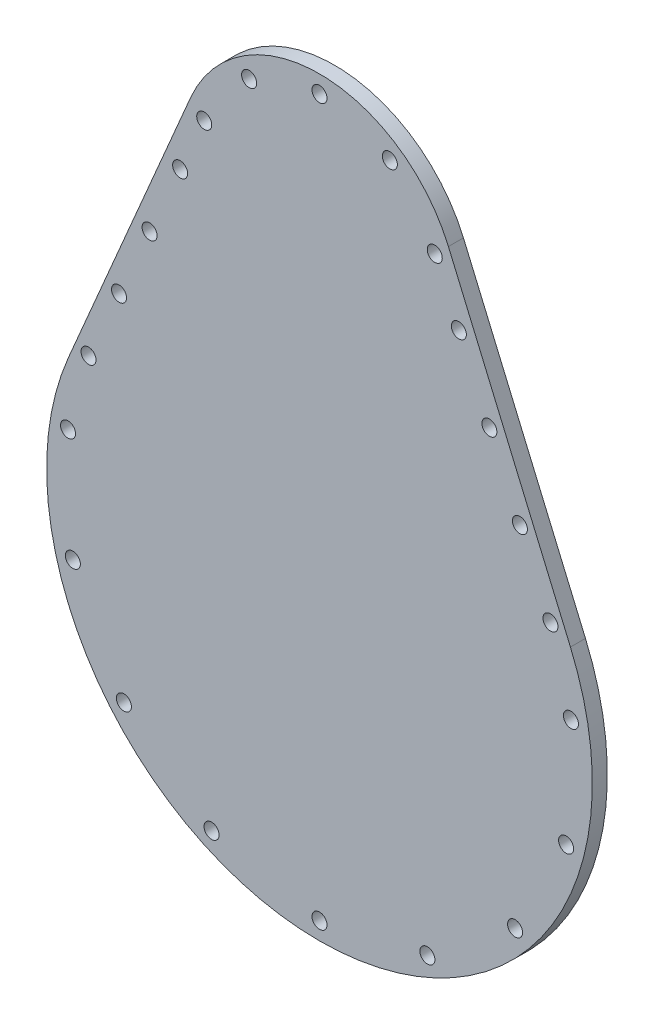
ISO-10303-21;
HEADER;
FILE_DESCRIPTION(('STEP AP214'),'2;1');
FILE_NAME('part.step','',(''),(''),'','','');
FILE_SCHEMA(('AUTOMOTIVE_DESIGN { 1 0 10303 214 1 1 1 1 }'));
ENDSEC;
DATA;
#1=APPLICATION_CONTEXT('core data for automotive mechanical design processes');
#2=APPLICATION_PROTOCOL_DEFINITION('international standard','automotive_design',2000,#1);
#3=PRODUCT_CONTEXT('',#1,'mechanical');
#4=PRODUCT('Part','Part','',(#3));
#5=PRODUCT_RELATED_PRODUCT_CATEGORY('part','',(#4));
#6=PRODUCT_DEFINITION_FORMATION('','',#4);
#7=PRODUCT_DEFINITION_CONTEXT('part definition',#1,'design');
#8=PRODUCT_DEFINITION('design','',#6,#7);
#9=PRODUCT_DEFINITION_SHAPE('','',#8);
#10=(LENGTH_UNIT() NAMED_UNIT(*) SI_UNIT(.MILLI.,.METRE.));
#11=(NAMED_UNIT(*) PLANE_ANGLE_UNIT() SI_UNIT($,.RADIAN.));
#12=(NAMED_UNIT(*) SI_UNIT($,.STERADIAN.) SOLID_ANGLE_UNIT());
#13=UNCERTAINTY_MEASURE_WITH_UNIT(LENGTH_MEASURE(1.E-05),#10,'distance_accuracy_value','');
#14=(GEOMETRIC_REPRESENTATION_CONTEXT(3) GLOBAL_UNCERTAINTY_ASSIGNED_CONTEXT((#13)) GLOBAL_UNIT_ASSIGNED_CONTEXT((#10,
#11,#12)) REPRESENTATION_CONTEXT('',''));
#15=CARTESIAN_POINT('',(0.,0.,0.));
#16=DIRECTION('',(0.,0.,1.));
#17=DIRECTION('',(1.,0.,0.));
#18=AXIS2_PLACEMENT_3D('',#15,#16,#17);
#19=CARTESIAN_POINT('',(-42.7223481292305,18.2366529492456,3.));
#20=DIRECTION('',(0.91971248563963,-0.392592592592593,0.));
#21=DIRECTION('',(0.392592592592593,0.91971248563963,0.));
#22=AXIS2_PLACEMENT_3D('',#19,#20,#21);
#23=PLANE('',#22);
#24=DIRECTION('',(-0.392592592592593,-0.91971248563963,0.));
#25=VECTOR('',#24,1.);
#26=CARTESIAN_POINT('',(-42.7223481292305,18.2366529492456,0.));
#27=LINE('',#26,#25);
#28=CARTESIAN_POINT('',(-25.7519495979096,57.9925925925926,0.));
#29=VERTEX_POINT('',#28);
#30=CARTESIAN_POINT('',(-50.1243304673598,0.896296296296305,0.));
#31=VERTEX_POINT('',#30);
#32=EDGE_CURVE('E198',#29,#31,#27,.T.);
#33=ORIENTED_EDGE('',*,*,#32,.T.);
#34=DIRECTION('',(0.,0.,-1.));
#35=VECTOR('',#34,1.);
#36=CARTESIAN_POINT('',(-50.1243304673598,0.896296296296305,3.));
#37=LINE('',#36,#35);
#38=CARTESIAN_POINT('',(-50.1243304673598,0.896296296296305,3.));
#39=VERTEX_POINT('',#38);
#40=EDGE_CURVE('E11',#39,#31,#37,.T.);
#41=ORIENTED_EDGE('',*,*,#40,.F.);
#42=DIRECTION('',(-0.392592592592593,-0.91971248563963,0.));
#43=VECTOR('',#42,1.);
#44=CARTESIAN_POINT('',(-42.7223481292305,18.2366529492456,3.));
#45=LINE('',#44,#43);
#46=CARTESIAN_POINT('',(-25.7519495979096,57.9925925925926,3.));
#47=VERTEX_POINT('',#46);
#48=EDGE_CURVE('E94',#47,#39,#45,.T.);
#49=ORIENTED_EDGE('',*,*,#48,.F.);
#50=DIRECTION('',(0.,0.,-1.));
#51=VECTOR('',#50,1.);
#52=CARTESIAN_POINT('',(-25.7519495979096,57.9925925925926,3.));
#53=LINE('',#52,#51);
#54=EDGE_CURVE('E106',#47,#29,#53,.T.);
#55=ORIENTED_EDGE('',*,*,#54,.T.);
#56=EDGE_LOOP('',(#33,#41,#49,#55));
#57=FACE_BOUND('',#56,.T.);
#58=ADVANCED_FACE('F41',(#57),#23,.F.);
#59=CARTESIAN_POINT('',(0.,-20.5,3.));
#60=DIRECTION('',(0.,0.,-1.));
#61=DIRECTION('',(-1.,0.,0.));
#62=AXIS2_PLACEMENT_3D('',#59,#60,#61);
#63=CYLINDRICAL_SURFACE('',#62,54.5);
#64=CARTESIAN_POINT('',(0.,-20.5,0.));
#65=DIRECTION('',(0.,0.,1.));
#66=DIRECTION('',(1.,0.,0.));
#67=AXIS2_PLACEMENT_3D('',#64,#65,#66);
#68=CIRCLE('',#67,54.5);
#69=CARTESIAN_POINT('',(50.1243304673599,0.896296296296277,0.));
#70=VERTEX_POINT('',#69);
#71=EDGE_CURVE('E99',#31,#70,#68,.T.);
#72=ORIENTED_EDGE('',*,*,#71,.T.);
#73=DIRECTION('',(0.,0.,-1.));
#74=VECTOR('',#73,1.);
#75=CARTESIAN_POINT('',(50.1243304673599,0.896296296296277,3.));
#76=LINE('',#75,#74);
#77=CARTESIAN_POINT('',(50.1243304673599,0.896296296296277,3.));
#78=VERTEX_POINT('',#77);
#79=EDGE_CURVE('E51',#78,#70,#76,.T.);
#80=ORIENTED_EDGE('',*,*,#79,.F.);
#81=CARTESIAN_POINT('',(0.,-20.5,3.));
#82=DIRECTION('',(0.,0.,1.));
#83=DIRECTION('',(1.,0.,0.));
#84=AXIS2_PLACEMENT_3D('',#81,#82,#83);
#85=CIRCLE('',#84,54.5);
#86=EDGE_CURVE('E89',#39,#78,#85,.T.);
#87=ORIENTED_EDGE('',*,*,#86,.F.);
#88=ORIENTED_EDGE('',*,*,#40,.T.);
#89=EDGE_LOOP('',(#72,#80,#87,#88));
#90=FACE_BOUND('',#89,.T.);
#91=ADVANCED_FACE('F98',(#90),#63,.T.);
#92=CARTESIAN_POINT('',(42.7223481292305,18.2366529492456,3.));
#93=DIRECTION('',(-0.91971248563963,-0.392592592592593,0.));
#94=DIRECTION('',(0.392592592592593,-0.91971248563963,0.));
#95=AXIS2_PLACEMENT_3D('',#92,#93,#94);
#96=PLANE('',#95);
#97=DIRECTION('',(-0.392592592592593,0.91971248563963,0.));
#98=VECTOR('',#97,1.);
#99=CARTESIAN_POINT('',(42.7223481292305,18.2366529492456,0.));
#100=LINE('',#99,#98);
#101=CARTESIAN_POINT('',(25.7519495979096,57.9925925925926,0.));
#102=VERTEX_POINT('',#101);
#103=EDGE_CURVE('E76',#70,#102,#100,.T.);
#104=ORIENTED_EDGE('',*,*,#103,.T.);
#105=DIRECTION('',(0.,0.,-1.));
#106=VECTOR('',#105,1.);
#107=CARTESIAN_POINT('',(25.7519495979096,57.9925925925926,3.));
#108=LINE('',#107,#106);
#109=CARTESIAN_POINT('',(25.7519495979096,57.9925925925926,3.));
#110=VERTEX_POINT('',#109);
#111=EDGE_CURVE('E101',#110,#102,#108,.T.);
#112=ORIENTED_EDGE('',*,*,#111,.F.);
#113=DIRECTION('',(-0.392592592592593,0.91971248563963,0.));
#114=VECTOR('',#113,1.);
#115=CARTESIAN_POINT('',(42.7223481292305,18.2366529492456,3.));
#116=LINE('',#115,#114);
#117=EDGE_CURVE('E92',#78,#110,#116,.T.);
#118=ORIENTED_EDGE('',*,*,#117,.F.);
#119=ORIENTED_EDGE('',*,*,#79,.T.);
#120=EDGE_LOOP('',(#104,#112,#118,#119));
#121=FACE_BOUND('',#120,.T.);
#122=ADVANCED_FACE('F102',(#121),#96,.F.);
#123=CARTESIAN_POINT('',(-23.0224692092564,55.3794935114811,3.));
#124=DIRECTION('',(0.,0.,-1.));
#125=DIRECTION('',(-1.,0.,0.));
#126=AXIS2_PLACEMENT_3D('',#123,#124,#125);
#127=CYLINDRICAL_SURFACE('',#126,1.5);
#128=CARTESIAN_POINT('',(-23.0224692092564,55.3794935114811,3.));
#129=DIRECTION('',(0.,0.,1.));
#130=DIRECTION('',(1.,0.,0.));
#131=AXIS2_PLACEMENT_3D('',#128,#129,#130);
#132=CIRCLE('',#131,1.5);
#133=CARTESIAN_POINT('',(-21.5224692092564,55.3794935114811,3.));
#134=VERTEX_POINT('',#133);
#135=EDGE_CURVE('E218',#134,#134,#132,.F.);
#136=ORIENTED_EDGE('',*,*,#135,.F.);
#137=EDGE_LOOP('',(#136));
#138=FACE_BOUND('',#137,.T.);
#139=CARTESIAN_POINT('',(-23.0224692092564,55.3794935114811,0.));
#140=DIRECTION('',(0.,0.,1.));
#141=DIRECTION('',(1.,0.,0.));
#142=AXIS2_PLACEMENT_3D('',#139,#140,#141);
#143=CIRCLE('',#142,1.5);
#144=CARTESIAN_POINT('',(-21.5224692092564,55.3794935114811,0.));
#145=VERTEX_POINT('',#144);
#146=EDGE_CURVE('E194',#145,#145,#143,.F.);
#147=ORIENTED_EDGE('',*,*,#146,.T.);
#148=EDGE_LOOP('',(#147));
#149=FACE_BOUND('',#148,.T.);
#150=ADVANCED_FACE('F354',(#138,#149),#127,.F.);
#151=CARTESIAN_POINT('',(-39.0682665990679,-53.2821680940134,3.));
#152=DIRECTION('',(0.,0.,-1.));
#153=DIRECTION('',(-1.,0.,0.));
#154=AXIS2_PLACEMENT_3D('',#151,#152,#153);
#155=CYLINDRICAL_SURFACE('',#154,1.5);
#156=CARTESIAN_POINT('',(-39.0682665990679,-53.2821680940134,3.));
#157=DIRECTION('',(0.,0.,1.));
#158=DIRECTION('',(1.,0.,0.));
#159=AXIS2_PLACEMENT_3D('',#156,#157,#158);
#160=CIRCLE('',#159,1.5);
#161=CARTESIAN_POINT('',(-37.5682665990679,-53.2821680940134,3.));
#162=VERTEX_POINT('',#161);
#163=EDGE_CURVE('E221',#162,#162,#160,.F.);
#164=ORIENTED_EDGE('',*,*,#163,.F.);
#165=EDGE_LOOP('',(#164));
#166=FACE_BOUND('',#165,.T.);
#167=CARTESIAN_POINT('',(-39.0682665990679,-53.2821680940134,0.));
#168=DIRECTION('',(0.,0.,1.));
#169=DIRECTION('',(1.,0.,0.));
#170=AXIS2_PLACEMENT_3D('',#167,#168,#169);
#171=CIRCLE('',#170,1.5);
#172=CARTESIAN_POINT('',(-37.5682665990679,-53.2821680940134,0.));
#173=VERTEX_POINT('',#172);
#174=EDGE_CURVE('E190',#173,#173,#171,.F.);
#175=ORIENTED_EDGE('',*,*,#174,.T.);
#176=EDGE_LOOP('',(#175));
#177=FACE_BOUND('',#176,.T.);
#178=ADVANCED_FACE('F357',(#166,#177),#155,.F.);
#179=CARTESIAN_POINT('',(-50.2251954036226,-11.6439429389864,3.));
#180=DIRECTION('',(0.,0.,-1.));
#181=DIRECTION('',(-1.,0.,0.));
#182=AXIS2_PLACEMENT_3D('',#179,#180,#181);
#183=CYLINDRICAL_SURFACE('',#182,1.5);
#184=CARTESIAN_POINT('',(-50.2251954036226,-11.6439429389864,3.));
#185=DIRECTION('',(0.,0.,1.));
#186=DIRECTION('',(1.,0.,0.));
#187=AXIS2_PLACEMENT_3D('',#184,#185,#186);
#188=CIRCLE('',#187,1.5);
#189=CARTESIAN_POINT('',(-48.7251954036226,-11.6439429389864,3.));
#190=VERTEX_POINT('',#189);
#191=EDGE_CURVE('E227',#190,#190,#188,.F.);
#192=ORIENTED_EDGE('',*,*,#191,.F.);
#193=EDGE_LOOP('',(#192));
#194=FACE_BOUND('',#193,.T.);
#195=CARTESIAN_POINT('',(-50.2251954036226,-11.6439429389864,0.));
#196=DIRECTION('',(0.,0.,1.));
#197=DIRECTION('',(1.,0.,0.));
#198=AXIS2_PLACEMENT_3D('',#195,#196,#197);
#199=CIRCLE('',#198,1.5);
#200=CARTESIAN_POINT('',(-48.7251954036226,-11.6439429389864,0.));
#201=VERTEX_POINT('',#200);
#202=EDGE_CURVE('E186',#201,#201,#199,.F.);
#203=ORIENTED_EDGE('',*,*,#202,.T.);
#204=EDGE_LOOP('',(#203));
#205=FACE_BOUND('',#204,.T.);
#206=ADVANCED_FACE('F378',(#194,#205),#183,.F.);
#207=CARTESIAN_POINT('',(-33.935175216127,30.7573079425519,3.));
#208=DIRECTION('',(0.,0.,-1.));
#209=DIRECTION('',(-1.,0.,0.));
#210=AXIS2_PLACEMENT_3D('',#207,#208,#209);
#211=CYLINDRICAL_SURFACE('',#210,1.5);
#212=CARTESIAN_POINT('',(-33.935175216127,30.7573079425519,3.));
#213=DIRECTION('',(0.,0.,1.));
#214=DIRECTION('',(1.,0.,0.));
#215=AXIS2_PLACEMENT_3D('',#212,#213,#214);
#216=CIRCLE('',#215,1.5);
#217=CARTESIAN_POINT('',(-32.435175216127,30.7573079425519,3.));
#218=VERTEX_POINT('',#217);
#219=EDGE_CURVE('E231',#218,#218,#216,.F.);
#220=ORIENTED_EDGE('',*,*,#219,.F.);
#221=EDGE_LOOP('',(#220));
#222=FACE_BOUND('',#221,.T.);
#223=CARTESIAN_POINT('',(-33.935175216127,30.7573079425519,0.));
#224=DIRECTION('',(0.,0.,1.));
#225=DIRECTION('',(1.,0.,0.));
#226=AXIS2_PLACEMENT_3D('',#223,#224,#225);
#227=CIRCLE('',#226,1.5);
#228=CARTESIAN_POINT('',(-32.435175216127,30.7573079425519,0.));
#229=VERTEX_POINT('',#228);
#230=EDGE_CURVE('E182',#229,#229,#227,.F.);
#231=ORIENTED_EDGE('',*,*,#230,.T.);
#232=EDGE_LOOP('',(#231));
#233=FACE_BOUND('',#232,.T.);
#234=ADVANCED_FACE('F382',(#222,#233),#211,.F.);
#235=CARTESIAN_POINT('',(-46.1348952943703,3.16004489712913,3.));
#236=DIRECTION('',(0.,0.,-1.));
#237=DIRECTION('',(-1.,0.,0.));
#238=AXIS2_PLACEMENT_3D('',#235,#236,#237);
#239=CYLINDRICAL_SURFACE('',#238,1.5);
#240=CARTESIAN_POINT('',(-46.1348952943703,3.16004489712913,3.));
#241=DIRECTION('',(0.,0.,1.));
#242=DIRECTION('',(1.,0.,0.));
#243=AXIS2_PLACEMENT_3D('',#240,#241,#242);
#244=CIRCLE('',#243,1.5);
#245=CARTESIAN_POINT('',(-44.6348952943703,3.16004489712913,3.));
#246=VERTEX_POINT('',#245);
#247=EDGE_CURVE('E235',#246,#246,#244,.F.);
#248=ORIENTED_EDGE('',*,*,#247,.F.);
#249=EDGE_LOOP('',(#248));
#250=FACE_BOUND('',#249,.T.);
#251=CARTESIAN_POINT('',(-46.1348952943703,3.16004489712913,0.));
#252=DIRECTION('',(0.,0.,1.));
#253=DIRECTION('',(1.,0.,0.));
#254=AXIS2_PLACEMENT_3D('',#251,#252,#253);
#255=CIRCLE('',#254,1.5);
#256=CARTESIAN_POINT('',(-44.6348952943703,3.16004489712913,0.));
#257=VERTEX_POINT('',#256);
#258=EDGE_CURVE('E178',#257,#257,#255,.F.);
#259=ORIENTED_EDGE('',*,*,#258,.T.);
#260=EDGE_LOOP('',(#259));
#261=FACE_BOUND('',#260,.T.);
#262=ADVANCED_FACE('F386',(#250,#261),#239,.F.);
#263=CARTESIAN_POINT('',(46.1348952943703,3.16004489712913,3.));
#264=DIRECTION('',(0.,0.,-1.));
#265=DIRECTION('',(-1.,0.,0.));
#266=AXIS2_PLACEMENT_3D('',#263,#264,#265);
#267=CYLINDRICAL_SURFACE('',#266,1.5);
#268=CARTESIAN_POINT('',(46.1348952943703,3.16004489712913,3.));
#269=DIRECTION('',(0.,0.,1.));
#270=DIRECTION('',(1.,0.,0.));
#271=AXIS2_PLACEMENT_3D('',#268,#269,#270);
#272=CIRCLE('',#271,1.5);
#273=CARTESIAN_POINT('',(47.6348952943703,3.16004489712913,3.));
#274=VERTEX_POINT('',#273);
#275=EDGE_CURVE('E239',#274,#274,#272,.T.);
#276=ORIENTED_EDGE('',*,*,#275,.T.);
#277=EDGE_LOOP('',(#276));
#278=FACE_BOUND('',#277,.T.);
#279=CARTESIAN_POINT('',(46.1348952943703,3.16004489712913,0.));
#280=DIRECTION('',(0.,0.,1.));
#281=DIRECTION('',(1.,0.,0.));
#282=AXIS2_PLACEMENT_3D('',#279,#280,#281);
#283=CIRCLE('',#282,1.5);
#284=CARTESIAN_POINT('',(47.6348952943703,3.16004489712913,0.));
#285=VERTEX_POINT('',#284);
#286=EDGE_CURVE('E174',#285,#285,#283,.T.);
#287=ORIENTED_EDGE('',*,*,#286,.F.);
#288=EDGE_LOOP('',(#287));
#289=FACE_BOUND('',#288,.T.);
#290=ADVANCED_FACE('F390',(#278,#289),#267,.F.);
#291=CARTESIAN_POINT('',(40.0350352552487,16.9586764198405,3.));
#292=DIRECTION('',(0.,0.,-1.));
#293=DIRECTION('',(-1.,0.,0.));
#294=AXIS2_PLACEMENT_3D('',#291,#292,#293);
#295=CYLINDRICAL_SURFACE('',#294,1.5);
#296=CARTESIAN_POINT('',(40.0350352552487,16.9586764198405,3.));
#297=DIRECTION('',(0.,0.,1.));
#298=DIRECTION('',(1.,0.,0.));
#299=AXIS2_PLACEMENT_3D('',#296,#297,#298);
#300=CIRCLE('',#299,1.5);
#301=CARTESIAN_POINT('',(41.5350352552487,16.9586764198405,3.));
#302=VERTEX_POINT('',#301);
#303=EDGE_CURVE('E243',#302,#302,#300,.T.);
#304=ORIENTED_EDGE('',*,*,#303,.T.);
#305=EDGE_LOOP('',(#304));
#306=FACE_BOUND('',#305,.T.);
#307=CARTESIAN_POINT('',(40.0350352552487,16.9586764198405,0.));
#308=DIRECTION('',(0.,0.,1.));
#309=DIRECTION('',(1.,0.,0.));
#310=AXIS2_PLACEMENT_3D('',#307,#308,#309);
#311=CIRCLE('',#310,1.5);
#312=CARTESIAN_POINT('',(41.5350352552487,16.9586764198405,0.));
#313=VERTEX_POINT('',#312);
#314=EDGE_CURVE('E170',#313,#313,#311,.T.);
#315=ORIENTED_EDGE('',*,*,#314,.F.);
#316=EDGE_LOOP('',(#315));
#317=FACE_BOUND('',#316,.T.);
#318=ADVANCED_FACE('F394',(#306,#317),#295,.F.);
#319=CARTESIAN_POINT('',(33.935175216127,30.7573079425519,3.));
#320=DIRECTION('',(0.,0.,-1.));
#321=DIRECTION('',(-1.,0.,0.));
#322=AXIS2_PLACEMENT_3D('',#319,#320,#321);
#323=CYLINDRICAL_SURFACE('',#322,1.5);
#324=CARTESIAN_POINT('',(33.935175216127,30.7573079425519,3.));
#325=DIRECTION('',(0.,0.,1.));
#326=DIRECTION('',(1.,0.,0.));
#327=AXIS2_PLACEMENT_3D('',#324,#325,#326);
#328=CIRCLE('',#327,1.5);
#329=CARTESIAN_POINT('',(35.435175216127,30.7573079425519,3.));
#330=VERTEX_POINT('',#329);
#331=EDGE_CURVE('E247',#330,#330,#328,.T.);
#332=ORIENTED_EDGE('',*,*,#331,.T.);
#333=EDGE_LOOP('',(#332));
#334=FACE_BOUND('',#333,.T.);
#335=CARTESIAN_POINT('',(33.935175216127,30.7573079425519,0.));
#336=DIRECTION('',(0.,0.,1.));
#337=DIRECTION('',(1.,0.,0.));
#338=AXIS2_PLACEMENT_3D('',#335,#336,#337);
#339=CIRCLE('',#338,1.5);
#340=CARTESIAN_POINT('',(35.435175216127,30.7573079425519,0.));
#341=VERTEX_POINT('',#340);
#342=EDGE_CURVE('E166',#341,#341,#339,.T.);
#343=ORIENTED_EDGE('',*,*,#342,.F.);
#344=EDGE_LOOP('',(#343));
#345=FACE_BOUND('',#344,.T.);
#346=ADVANCED_FACE('F398',(#334,#345),#323,.F.);
#347=CARTESIAN_POINT('',(27.8353151770053,44.5559394652633,3.));
#348=DIRECTION('',(0.,0.,-1.));
#349=DIRECTION('',(-1.,0.,0.));
#350=AXIS2_PLACEMENT_3D('',#347,#348,#349);
#351=CYLINDRICAL_SURFACE('',#350,1.5);
#352=CARTESIAN_POINT('',(27.8353151770053,44.5559394652633,3.));
#353=DIRECTION('',(0.,0.,1.));
#354=DIRECTION('',(1.,0.,0.));
#355=AXIS2_PLACEMENT_3D('',#352,#353,#354);
#356=CIRCLE('',#355,1.5);
#357=CARTESIAN_POINT('',(29.3353151770053,44.5559394652633,3.));
#358=VERTEX_POINT('',#357);
#359=EDGE_CURVE('E251',#358,#358,#356,.T.);
#360=ORIENTED_EDGE('',*,*,#359,.T.);
#361=EDGE_LOOP('',(#360));
#362=FACE_BOUND('',#361,.T.);
#363=CARTESIAN_POINT('',(27.8353151770053,44.5559394652633,0.));
#364=DIRECTION('',(0.,0.,1.));
#365=DIRECTION('',(1.,0.,0.));
#366=AXIS2_PLACEMENT_3D('',#363,#364,#365);
#367=CIRCLE('',#366,1.5);
#368=CARTESIAN_POINT('',(29.3353151770053,44.5559394652633,0.));
#369=VERTEX_POINT('',#368);
#370=EDGE_CURVE('E162',#369,#369,#367,.T.);
#371=ORIENTED_EDGE('',*,*,#370,.F.);
#372=EDGE_LOOP('',(#371));
#373=FACE_BOUND('',#372,.T.);
#374=ADVANCED_FACE('F402',(#362,#373),#351,.F.);
#375=CARTESIAN_POINT('',(50.2251954036226,-11.6439429389864,3.));
#376=DIRECTION('',(0.,0.,-1.));
#377=DIRECTION('',(-1.,0.,0.));
#378=AXIS2_PLACEMENT_3D('',#375,#376,#377);
#379=CYLINDRICAL_SURFACE('',#378,1.5);
#380=CARTESIAN_POINT('',(50.2251954036226,-11.6439429389864,3.));
#381=DIRECTION('',(0.,0.,1.));
#382=DIRECTION('',(1.,0.,0.));
#383=AXIS2_PLACEMENT_3D('',#380,#381,#382);
#384=CIRCLE('',#383,1.5);
#385=CARTESIAN_POINT('',(51.7251954036226,-11.6439429389864,3.));
#386=VERTEX_POINT('',#385);
#387=EDGE_CURVE('E255',#386,#386,#384,.T.);
#388=ORIENTED_EDGE('',*,*,#387,.T.);
#389=EDGE_LOOP('',(#388));
#390=FACE_BOUND('',#389,.T.);
#391=CARTESIAN_POINT('',(50.2251954036226,-11.6439429389864,0.));
#392=DIRECTION('',(0.,0.,1.));
#393=DIRECTION('',(1.,0.,0.));
#394=AXIS2_PLACEMENT_3D('',#391,#392,#393);
#395=CIRCLE('',#394,1.5);
#396=CARTESIAN_POINT('',(51.7251954036226,-11.6439429389864,0.));
#397=VERTEX_POINT('',#396);
#398=EDGE_CURVE('E158',#397,#397,#395,.T.);
#399=ORIENTED_EDGE('',*,*,#398,.F.);
#400=EDGE_LOOP('',(#399));
#401=FACE_BOUND('',#400,.T.);
#402=ADVANCED_FACE('F406',(#390,#401),#379,.F.);
#403=CARTESIAN_POINT('',(49.2622171407425,-33.6997713002284,3.));
#404=DIRECTION('',(0.,0.,-1.));
#405=DIRECTION('',(-1.,0.,0.));
#406=AXIS2_PLACEMENT_3D('',#403,#404,#405);
#407=CYLINDRICAL_SURFACE('',#406,1.5);
#408=CARTESIAN_POINT('',(49.2622171407425,-33.6997713002284,3.));
#409=DIRECTION('',(0.,0.,1.));
#410=DIRECTION('',(1.,0.,0.));
#411=AXIS2_PLACEMENT_3D('',#408,#409,#410);
#412=CIRCLE('',#411,1.5);
#413=CARTESIAN_POINT('',(50.7622171407425,-33.6997713002284,3.));
#414=VERTEX_POINT('',#413);
#415=EDGE_CURVE('E259',#414,#414,#412,.T.);
#416=ORIENTED_EDGE('',*,*,#415,.T.);
#417=EDGE_LOOP('',(#416));
#418=FACE_BOUND('',#417,.T.);
#419=CARTESIAN_POINT('',(49.2622171407425,-33.6997713002284,0.));
#420=DIRECTION('',(0.,0.,1.));
#421=DIRECTION('',(1.,0.,0.));
#422=AXIS2_PLACEMENT_3D('',#419,#420,#421);
#423=CIRCLE('',#422,1.5);
#424=CARTESIAN_POINT('',(50.7622171407425,-33.6997713002284,0.));
#425=VERTEX_POINT('',#424);
#426=EDGE_CURVE('E154',#425,#425,#423,.T.);
#427=ORIENTED_EDGE('',*,*,#426,.F.);
#428=EDGE_LOOP('',(#427));
#429=FACE_BOUND('',#428,.T.);
#430=ADVANCED_FACE('F410',(#418,#429),#407,.F.);
#431=CARTESIAN_POINT('',(39.0682665990679,-53.2821680940134,3.));
#432=DIRECTION('',(0.,0.,-1.));
#433=DIRECTION('',(-1.,0.,0.));
#434=AXIS2_PLACEMENT_3D('',#431,#432,#433);
#435=CYLINDRICAL_SURFACE('',#434,1.5);
#436=CARTESIAN_POINT('',(39.0682665990679,-53.2821680940134,3.));
#437=DIRECTION('',(0.,0.,1.));
#438=DIRECTION('',(1.,0.,0.));
#439=AXIS2_PLACEMENT_3D('',#436,#437,#438);
#440=CIRCLE('',#439,1.5);
#441=CARTESIAN_POINT('',(40.5682665990679,-53.2821680940134,3.));
#442=VERTEX_POINT('',#441);
#443=EDGE_CURVE('E263',#442,#442,#440,.T.);
#444=ORIENTED_EDGE('',*,*,#443,.T.);
#445=EDGE_LOOP('',(#444));
#446=FACE_BOUND('',#445,.T.);
#447=CARTESIAN_POINT('',(39.0682665990679,-53.2821680940134,0.));
#448=DIRECTION('',(0.,0.,1.));
#449=DIRECTION('',(1.,0.,0.));
#450=AXIS2_PLACEMENT_3D('',#447,#448,#449);
#451=CIRCLE('',#450,1.5);
#452=CARTESIAN_POINT('',(40.5682665990679,-53.2821680940134,0.));
#453=VERTEX_POINT('',#452);
#454=EDGE_CURVE('E150',#453,#453,#451,.T.);
#455=ORIENTED_EDGE('',*,*,#454,.F.);
#456=EDGE_LOOP('',(#455));
#457=FACE_BOUND('',#456,.T.);
#458=ADVANCED_FACE('F414',(#446,#457),#435,.F.);
#459=CARTESIAN_POINT('',(21.5535313487757,-66.7216971388691,3.));
#460=DIRECTION('',(0.,0.,-1.));
#461=DIRECTION('',(-1.,0.,0.));
#462=AXIS2_PLACEMENT_3D('',#459,#460,#461);
#463=CYLINDRICAL_SURFACE('',#462,1.5);
#464=CARTESIAN_POINT('',(21.5535313487757,-66.7216971388691,3.));
#465=DIRECTION('',(0.,0.,1.));
#466=DIRECTION('',(1.,0.,0.));
#467=AXIS2_PLACEMENT_3D('',#464,#465,#466);
#468=CIRCLE('',#467,1.5);
#469=CARTESIAN_POINT('',(23.0535313487757,-66.7216971388691,3.));
#470=VERTEX_POINT('',#469);
#471=EDGE_CURVE('E267',#470,#470,#468,.T.);
#472=ORIENTED_EDGE('',*,*,#471,.T.);
#473=EDGE_LOOP('',(#472));
#474=FACE_BOUND('',#473,.T.);
#475=CARTESIAN_POINT('',(21.5535313487757,-66.7216971388691,0.));
#476=DIRECTION('',(0.,0.,1.));
#477=DIRECTION('',(1.,0.,0.));
#478=AXIS2_PLACEMENT_3D('',#475,#476,#477);
#479=CIRCLE('',#478,1.5);
#480=CARTESIAN_POINT('',(23.0535313487757,-66.7216971388691,0.));
#481=VERTEX_POINT('',#480);
#482=EDGE_CURVE('E146',#481,#481,#479,.T.);
#483=ORIENTED_EDGE('',*,*,#482,.F.);
#484=EDGE_LOOP('',(#483));
#485=FACE_BOUND('',#484,.T.);
#486=ADVANCED_FACE('F418',(#474,#485),#463,.F.);
#487=CARTESIAN_POINT('',(23.0224692092564,55.3794935114811,3.));
#488=DIRECTION('',(0.,0.,-1.));
#489=DIRECTION('',(-1.,0.,0.));
#490=AXIS2_PLACEMENT_3D('',#487,#488,#489);
#491=CYLINDRICAL_SURFACE('',#490,1.5);
#492=CARTESIAN_POINT('',(23.0224692092564,55.3794935114811,3.));
#493=DIRECTION('',(0.,0.,1.));
#494=DIRECTION('',(1.,0.,0.));
#495=AXIS2_PLACEMENT_3D('',#492,#493,#494);
#496=CIRCLE('',#495,1.5);
#497=CARTESIAN_POINT('',(24.5224692092564,55.3794935114811,3.));
#498=VERTEX_POINT('',#497);
#499=EDGE_CURVE('E271',#498,#498,#496,.T.);
#500=ORIENTED_EDGE('',*,*,#499,.T.);
#501=EDGE_LOOP('',(#500));
#502=FACE_BOUND('',#501,.T.);
#503=CARTESIAN_POINT('',(23.0224692092564,55.3794935114811,0.));
#504=DIRECTION('',(0.,0.,1.));
#505=DIRECTION('',(1.,0.,0.));
#506=AXIS2_PLACEMENT_3D('',#503,#504,#505);
#507=CIRCLE('',#506,1.5);
#508=CARTESIAN_POINT('',(24.5224692092564,55.3794935114811,0.));
#509=VERTEX_POINT('',#508);
#510=EDGE_CURVE('E142',#509,#509,#507,.T.);
#511=ORIENTED_EDGE('',*,*,#510,.F.);
#512=EDGE_LOOP('',(#511));
#513=FACE_BOUND('',#512,.T.);
#514=ADVANCED_FACE('F422',(#502,#513),#491,.F.);
#515=CARTESIAN_POINT('',(14.0526226906011,67.0692250850817,3.));
#516=DIRECTION('',(0.,0.,-1.));
#517=DIRECTION('',(-1.,0.,0.));
#518=AXIS2_PLACEMENT_3D('',#515,#516,#517);
#519=CYLINDRICAL_SURFACE('',#518,1.5);
#520=CARTESIAN_POINT('',(14.0526226906011,67.0692250850817,3.));
#521=DIRECTION('',(0.,0.,1.));
#522=DIRECTION('',(1.,0.,0.));
#523=AXIS2_PLACEMENT_3D('',#520,#521,#522);
#524=CIRCLE('',#523,1.5);
#525=CARTESIAN_POINT('',(15.5526226906011,67.0692250850817,3.));
#526=VERTEX_POINT('',#525);
#527=EDGE_CURVE('E275',#526,#526,#524,.T.);
#528=ORIENTED_EDGE('',*,*,#527,.T.);
#529=EDGE_LOOP('',(#528));
#530=FACE_BOUND('',#529,.T.);
#531=CARTESIAN_POINT('',(14.0526226906011,67.0692250850817,0.));
#532=DIRECTION('',(0.,0.,1.));
#533=DIRECTION('',(1.,0.,0.));
#534=AXIS2_PLACEMENT_3D('',#531,#532,#533);
#535=CIRCLE('',#534,1.5);
#536=CARTESIAN_POINT('',(15.5526226906011,67.0692250850817,0.));
#537=VERTEX_POINT('',#536);
#538=EDGE_CURVE('E138',#537,#537,#535,.T.);
#539=ORIENTED_EDGE('',*,*,#538,.F.);
#540=EDGE_LOOP('',(#539));
#541=FACE_BOUND('',#540,.T.);
#542=ADVANCED_FACE('F426',(#530,#541),#519,.F.);
#543=CARTESIAN_POINT('',(0.,-71.5,3.));
#544=DIRECTION('',(0.,0.,-1.));
#545=DIRECTION('',(-1.,0.,0.));
#546=AXIS2_PLACEMENT_3D('',#543,#544,#545);
#547=CYLINDRICAL_SURFACE('',#546,1.5);
#548=CARTESIAN_POINT('',(0.,-71.5,3.));
#549=DIRECTION('',(0.,0.,1.));
#550=DIRECTION('',(1.,0.,0.));
#551=AXIS2_PLACEMENT_3D('',#548,#549,#550);
#552=CIRCLE('',#551,1.5);
#553=CARTESIAN_POINT('',(1.5,-71.5,3.));
#554=VERTEX_POINT('',#553);
#555=EDGE_CURVE('E279',#554,#554,#552,.T.);
#556=ORIENTED_EDGE('',*,*,#555,.T.);
#557=EDGE_LOOP('',(#556));
#558=FACE_BOUND('',#557,.T.);
#559=CARTESIAN_POINT('',(0.,-71.5,0.));
#560=DIRECTION('',(0.,0.,1.));
#561=DIRECTION('',(1.,0.,0.));
#562=AXIS2_PLACEMENT_3D('',#559,#560,#561);
#563=CIRCLE('',#562,1.5);
#564=CARTESIAN_POINT('',(1.5,-71.5,0.));
#565=VERTEX_POINT('',#564);
#566=EDGE_CURVE('E134',#565,#565,#563,.T.);
#567=ORIENTED_EDGE('',*,*,#566,.F.);
#568=EDGE_LOOP('',(#567));
#569=FACE_BOUND('',#568,.T.);
#570=ADVANCED_FACE('F430',(#558,#569),#547,.F.);
#571=CARTESIAN_POINT('',(-40.0350352552487,16.9586764198405,3.));
#572=DIRECTION('',(0.,0.,-1.));
#573=DIRECTION('',(-1.,0.,0.));
#574=AXIS2_PLACEMENT_3D('',#571,#572,#573);
#575=CYLINDRICAL_SURFACE('',#574,1.5);
#576=CARTESIAN_POINT('',(-40.0350352552487,16.9586764198405,3.));
#577=DIRECTION('',(0.,0.,1.));
#578=DIRECTION('',(1.,0.,0.));
#579=AXIS2_PLACEMENT_3D('',#576,#577,#578);
#580=CIRCLE('',#579,1.5);
#581=CARTESIAN_POINT('',(-38.5350352552487,16.9586764198405,3.));
#582=VERTEX_POINT('',#581);
#583=EDGE_CURVE('E283',#582,#582,#580,.F.);
#584=ORIENTED_EDGE('',*,*,#583,.F.);
#585=EDGE_LOOP('',(#584));
#586=FACE_BOUND('',#585,.T.);
#587=CARTESIAN_POINT('',(-40.0350352552487,16.9586764198405,0.));
#588=DIRECTION('',(0.,0.,1.));
#589=DIRECTION('',(1.,0.,0.));
#590=AXIS2_PLACEMENT_3D('',#587,#588,#589);
#591=CIRCLE('',#590,1.5);
#592=CARTESIAN_POINT('',(-38.5350352552487,16.9586764198405,0.));
#593=VERTEX_POINT('',#592);
#594=EDGE_CURVE('E130',#593,#593,#591,.F.);
#595=ORIENTED_EDGE('',*,*,#594,.T.);
#596=EDGE_LOOP('',(#595));
#597=FACE_BOUND('',#596,.T.);
#598=ADVANCED_FACE('F434',(#586,#597),#575,.F.);
#599=CARTESIAN_POINT('',(-27.8353151770053,44.5559394652633,3.));
#600=DIRECTION('',(0.,0.,-1.));
#601=DIRECTION('',(-1.,0.,0.));
#602=AXIS2_PLACEMENT_3D('',#599,#600,#601);
#603=CYLINDRICAL_SURFACE('',#602,1.5);
#604=CARTESIAN_POINT('',(-27.8353151770053,44.5559394652633,3.));
#605=DIRECTION('',(0.,0.,1.));
#606=DIRECTION('',(1.,0.,0.));
#607=AXIS2_PLACEMENT_3D('',#604,#605,#606);
#608=CIRCLE('',#607,1.5);
#609=CARTESIAN_POINT('',(-26.3353151770053,44.5559394652633,3.));
#610=VERTEX_POINT('',#609);
#611=EDGE_CURVE('E287',#610,#610,#608,.F.);
#612=ORIENTED_EDGE('',*,*,#611,.F.);
#613=EDGE_LOOP('',(#612));
#614=FACE_BOUND('',#613,.T.);
#615=CARTESIAN_POINT('',(-27.8353151770053,44.5559394652633,0.));
#616=DIRECTION('',(0.,0.,1.));
#617=DIRECTION('',(1.,0.,0.));
#618=AXIS2_PLACEMENT_3D('',#615,#616,#617);
#619=CIRCLE('',#618,1.5);
#620=CARTESIAN_POINT('',(-26.3353151770053,44.5559394652633,0.));
#621=VERTEX_POINT('',#620);
#622=EDGE_CURVE('E126',#621,#621,#619,.F.);
#623=ORIENTED_EDGE('',*,*,#622,.T.);
#624=EDGE_LOOP('',(#623));
#625=FACE_BOUND('',#624,.T.);
#626=ADVANCED_FACE('F438',(#614,#625),#603,.F.);
#627=CARTESIAN_POINT('',(-49.2622171407425,-33.6997713002284,3.));
#628=DIRECTION('',(0.,0.,-1.));
#629=DIRECTION('',(-1.,0.,0.));
#630=AXIS2_PLACEMENT_3D('',#627,#628,#629);
#631=CYLINDRICAL_SURFACE('',#630,1.5);
#632=CARTESIAN_POINT('',(-49.2622171407425,-33.6997713002284,3.));
#633=DIRECTION('',(0.,0.,1.));
#634=DIRECTION('',(1.,0.,0.));
#635=AXIS2_PLACEMENT_3D('',#632,#633,#634);
#636=CIRCLE('',#635,1.5);
#637=CARTESIAN_POINT('',(-47.7622171407425,-33.6997713002284,3.));
#638=VERTEX_POINT('',#637);
#639=EDGE_CURVE('E291',#638,#638,#636,.F.);
#640=ORIENTED_EDGE('',*,*,#639,.F.);
#641=EDGE_LOOP('',(#640));
#642=FACE_BOUND('',#641,.T.);
#643=CARTESIAN_POINT('',(-49.2622171407425,-33.6997713002284,0.));
#644=DIRECTION('',(0.,0.,1.));
#645=DIRECTION('',(1.,0.,0.));
#646=AXIS2_PLACEMENT_3D('',#643,#644,#645);
#647=CIRCLE('',#646,1.5);
#648=CARTESIAN_POINT('',(-47.7622171407425,-33.6997713002284,0.));
#649=VERTEX_POINT('',#648);
#650=EDGE_CURVE('E122',#649,#649,#647,.F.);
#651=ORIENTED_EDGE('',*,*,#650,.T.);
#652=EDGE_LOOP('',(#651));
#653=FACE_BOUND('',#652,.T.);
#654=ADVANCED_FACE('F442',(#642,#653),#631,.F.);
#655=CARTESIAN_POINT('',(-21.5535313487757,-66.7216971388691,3.));
#656=DIRECTION('',(0.,0.,-1.));
#657=DIRECTION('',(-1.,0.,0.));
#658=AXIS2_PLACEMENT_3D('',#655,#656,#657);
#659=CYLINDRICAL_SURFACE('',#658,1.5);
#660=CARTESIAN_POINT('',(-21.5535313487757,-66.7216971388691,3.));
#661=DIRECTION('',(0.,0.,1.));
#662=DIRECTION('',(1.,0.,0.));
#663=AXIS2_PLACEMENT_3D('',#660,#661,#662);
#664=CIRCLE('',#663,1.5);
#665=CARTESIAN_POINT('',(-20.0535313487757,-66.7216971388691,3.));
#666=VERTEX_POINT('',#665);
#667=EDGE_CURVE('E295',#666,#666,#664,.F.);
#668=ORIENTED_EDGE('',*,*,#667,.F.);
#669=EDGE_LOOP('',(#668));
#670=FACE_BOUND('',#669,.T.);
#671=CARTESIAN_POINT('',(-21.5535313487757,-66.7216971388691,0.));
#672=DIRECTION('',(0.,0.,1.));
#673=DIRECTION('',(1.,0.,0.));
#674=AXIS2_PLACEMENT_3D('',#671,#672,#673);
#675=CIRCLE('',#674,1.5);
#676=CARTESIAN_POINT('',(-20.0535313487757,-66.7216971388691,0.));
#677=VERTEX_POINT('',#676);
#678=EDGE_CURVE('E118',#677,#677,#675,.F.);
#679=ORIENTED_EDGE('',*,*,#678,.T.);
#680=EDGE_LOOP('',(#679));
#681=FACE_BOUND('',#680,.T.);
#682=ADVANCED_FACE('F446',(#670,#681),#659,.F.);
#683=CARTESIAN_POINT('',(-14.0526226906011,67.0692250850817,3.));
#684=DIRECTION('',(0.,0.,-1.));
#685=DIRECTION('',(-1.,0.,0.));
#686=AXIS2_PLACEMENT_3D('',#683,#684,#685);
#687=CYLINDRICAL_SURFACE('',#686,1.5);
#688=CARTESIAN_POINT('',(-14.0526226906011,67.0692250850817,3.));
#689=DIRECTION('',(0.,0.,1.));
#690=DIRECTION('',(1.,0.,0.));
#691=AXIS2_PLACEMENT_3D('',#688,#689,#690);
#692=CIRCLE('',#691,1.5);
#693=CARTESIAN_POINT('',(-12.5526226906011,67.0692250850817,3.));
#694=VERTEX_POINT('',#693);
#695=EDGE_CURVE('E299',#694,#694,#692,.F.);
#696=ORIENTED_EDGE('',*,*,#695,.F.);
#697=EDGE_LOOP('',(#696));
#698=FACE_BOUND('',#697,.T.);
#699=CARTESIAN_POINT('',(-14.0526226906011,67.0692250850817,0.));
#700=DIRECTION('',(0.,0.,1.));
#701=DIRECTION('',(1.,0.,0.));
#702=AXIS2_PLACEMENT_3D('',#699,#700,#701);
#703=CIRCLE('',#702,1.5);
#704=CARTESIAN_POINT('',(-12.5526226906011,67.0692250850817,0.));
#705=VERTEX_POINT('',#704);
#706=EDGE_CURVE('E114',#705,#705,#703,.F.);
#707=ORIENTED_EDGE('',*,*,#706,.T.);
#708=EDGE_LOOP('',(#707));
#709=FACE_BOUND('',#708,.T.);
#710=ADVANCED_FACE('F449',(#698,#709),#687,.F.);
#711=CARTESIAN_POINT('',(0.,71.5,3.));
#712=DIRECTION('',(0.,0.,-1.));
#713=DIRECTION('',(-1.,0.,0.));
#714=AXIS2_PLACEMENT_3D('',#711,#712,#713);
#715=CYLINDRICAL_SURFACE('',#714,1.5);
#716=CARTESIAN_POINT('',(0.,71.5,3.));
#717=DIRECTION('',(0.,0.,1.));
#718=DIRECTION('',(1.,0.,0.));
#719=AXIS2_PLACEMENT_3D('',#716,#717,#718);
#720=CIRCLE('',#719,1.5);
#721=CARTESIAN_POINT('',(1.5,71.5,3.));
#722=VERTEX_POINT('',#721);
#723=EDGE_CURVE('E208',#722,#722,#720,.T.);
#724=ORIENTED_EDGE('',*,*,#723,.T.);
#725=EDGE_LOOP('',(#724));
#726=FACE_BOUND('',#725,.T.);
#727=CARTESIAN_POINT('',(0.,71.5,0.));
#728=DIRECTION('',(0.,0.,1.));
#729=DIRECTION('',(1.,0.,0.));
#730=AXIS2_PLACEMENT_3D('',#727,#728,#729);
#731=CIRCLE('',#730,1.5);
#732=CARTESIAN_POINT('',(1.5,71.5,0.));
#733=VERTEX_POINT('',#732);
#734=EDGE_CURVE('E110',#733,#733,#731,.T.);
#735=ORIENTED_EDGE('',*,*,#734,.F.);
#736=EDGE_LOOP('',(#735));
#737=FACE_BOUND('',#736,.T.);
#738=ADVANCED_FACE('F43',(#726,#737),#715,.F.);
#739=CARTESIAN_POINT('',(0.,47.,3.));
#740=DIRECTION('',(0.,0.,-1.));
#741=DIRECTION('',(-1.,0.,0.));
#742=AXIS2_PLACEMENT_3D('',#739,#740,#741);
#743=CYLINDRICAL_SURFACE('',#742,28.);
#744=CARTESIAN_POINT('',(0.,47.,0.));
#745=DIRECTION('',(0.,0.,1.));
#746=DIRECTION('',(1.,0.,0.));
#747=AXIS2_PLACEMENT_3D('',#744,#745,#746);
#748=CIRCLE('',#747,28.);
#749=EDGE_CURVE('E82',#102,#29,#748,.T.);
#750=ORIENTED_EDGE('',*,*,#749,.T.);
#751=ORIENTED_EDGE('',*,*,#54,.F.);
#752=CARTESIAN_POINT('',(0.,47.,3.));
#753=DIRECTION('',(0.,0.,1.));
#754=DIRECTION('',(1.,0.,0.));
#755=AXIS2_PLACEMENT_3D('',#752,#753,#754);
#756=CIRCLE('',#755,28.);
#757=EDGE_CURVE('E59',#110,#47,#756,.T.);
#758=ORIENTED_EDGE('',*,*,#757,.F.);
#759=ORIENTED_EDGE('',*,*,#111,.T.);
#760=EDGE_LOOP('',(#750,#751,#758,#759));
#761=FACE_BOUND('',#760,.T.);
#762=ADVANCED_FACE('F212',(#761),#743,.T.);
#763=CARTESIAN_POINT('',(0.,0.,3.));
#764=DIRECTION('',(0.,0.,1.));
#765=DIRECTION('',(1.,0.,0.));
#766=AXIS2_PLACEMENT_3D('',#763,#764,#765);
#767=PLANE('',#766);
#768=ORIENTED_EDGE('',*,*,#723,.F.);
#769=EDGE_LOOP('',(#768));
#770=FACE_BOUND('',#769,.T.);
#771=ORIENTED_EDGE('',*,*,#695,.T.);
#772=EDGE_LOOP('',(#771));
#773=FACE_BOUND('',#772,.T.);
#774=ORIENTED_EDGE('',*,*,#667,.T.);
#775=EDGE_LOOP('',(#774));
#776=FACE_BOUND('',#775,.T.);
#777=ORIENTED_EDGE('',*,*,#639,.T.);
#778=EDGE_LOOP('',(#777));
#779=FACE_BOUND('',#778,.T.);
#780=ORIENTED_EDGE('',*,*,#611,.T.);
#781=EDGE_LOOP('',(#780));
#782=FACE_BOUND('',#781,.T.);
#783=ORIENTED_EDGE('',*,*,#583,.T.);
#784=EDGE_LOOP('',(#783));
#785=FACE_BOUND('',#784,.T.);
#786=ORIENTED_EDGE('',*,*,#555,.F.);
#787=EDGE_LOOP('',(#786));
#788=FACE_BOUND('',#787,.T.);
#789=ORIENTED_EDGE('',*,*,#527,.F.);
#790=EDGE_LOOP('',(#789));
#791=FACE_BOUND('',#790,.T.);
#792=ORIENTED_EDGE('',*,*,#499,.F.);
#793=EDGE_LOOP('',(#792));
#794=FACE_BOUND('',#793,.T.);
#795=ORIENTED_EDGE('',*,*,#471,.F.);
#796=EDGE_LOOP('',(#795));
#797=FACE_BOUND('',#796,.T.);
#798=ORIENTED_EDGE('',*,*,#443,.F.);
#799=EDGE_LOOP('',(#798));
#800=FACE_BOUND('',#799,.T.);
#801=ORIENTED_EDGE('',*,*,#415,.F.);
#802=EDGE_LOOP('',(#801));
#803=FACE_BOUND('',#802,.T.);
#804=ORIENTED_EDGE('',*,*,#387,.F.);
#805=EDGE_LOOP('',(#804));
#806=FACE_BOUND('',#805,.T.);
#807=ORIENTED_EDGE('',*,*,#359,.F.);
#808=EDGE_LOOP('',(#807));
#809=FACE_BOUND('',#808,.T.);
#810=ORIENTED_EDGE('',*,*,#331,.F.);
#811=EDGE_LOOP('',(#810));
#812=FACE_BOUND('',#811,.T.);
#813=ORIENTED_EDGE('',*,*,#303,.F.);
#814=EDGE_LOOP('',(#813));
#815=FACE_BOUND('',#814,.T.);
#816=ORIENTED_EDGE('',*,*,#275,.F.);
#817=EDGE_LOOP('',(#816));
#818=FACE_BOUND('',#817,.T.);
#819=ORIENTED_EDGE('',*,*,#247,.T.);
#820=EDGE_LOOP('',(#819));
#821=FACE_BOUND('',#820,.T.);
#822=ORIENTED_EDGE('',*,*,#219,.T.);
#823=EDGE_LOOP('',(#822));
#824=FACE_BOUND('',#823,.T.);
#825=ORIENTED_EDGE('',*,*,#191,.T.);
#826=EDGE_LOOP('',(#825));
#827=FACE_BOUND('',#826,.T.);
#828=ORIENTED_EDGE('',*,*,#163,.T.);
#829=EDGE_LOOP('',(#828));
#830=FACE_BOUND('',#829,.T.);
#831=ORIENTED_EDGE('',*,*,#135,.T.);
#832=EDGE_LOOP('',(#831));
#833=FACE_BOUND('',#832,.T.);
#834=ORIENTED_EDGE('',*,*,#48,.T.);
#835=ORIENTED_EDGE('',*,*,#86,.T.);
#836=ORIENTED_EDGE('',*,*,#117,.T.);
#837=ORIENTED_EDGE('',*,*,#757,.T.);
#838=EDGE_LOOP('',(#834,#835,#836,#837));
#839=FACE_BOUND('',#838,.T.);
#840=ADVANCED_FACE('F90',(#770,#773,#776,#779,#782,#785,#788,#791,#794,#797,#800,#803,#806,#809,
#812,#815,#818,#821,#824,#827,#830,#833,#839),#767,.T.);
#841=CARTESIAN_POINT('',(0.,0.,0.));
#842=DIRECTION('',(0.,0.,1.));
#843=DIRECTION('',(1.,0.,0.));
#844=AXIS2_PLACEMENT_3D('',#841,#842,#843);
#845=PLANE('',#844);
#846=ORIENTED_EDGE('',*,*,#734,.T.);
#847=EDGE_LOOP('',(#846));
#848=FACE_BOUND('',#847,.T.);
#849=ORIENTED_EDGE('',*,*,#706,.F.);
#850=EDGE_LOOP('',(#849));
#851=FACE_BOUND('',#850,.T.);
#852=ORIENTED_EDGE('',*,*,#678,.F.);
#853=EDGE_LOOP('',(#852));
#854=FACE_BOUND('',#853,.T.);
#855=ORIENTED_EDGE('',*,*,#650,.F.);
#856=EDGE_LOOP('',(#855));
#857=FACE_BOUND('',#856,.T.);
#858=ORIENTED_EDGE('',*,*,#622,.F.);
#859=EDGE_LOOP('',(#858));
#860=FACE_BOUND('',#859,.T.);
#861=ORIENTED_EDGE('',*,*,#594,.F.);
#862=EDGE_LOOP('',(#861));
#863=FACE_BOUND('',#862,.T.);
#864=ORIENTED_EDGE('',*,*,#566,.T.);
#865=EDGE_LOOP('',(#864));
#866=FACE_BOUND('',#865,.T.);
#867=ORIENTED_EDGE('',*,*,#538,.T.);
#868=EDGE_LOOP('',(#867));
#869=FACE_BOUND('',#868,.T.);
#870=ORIENTED_EDGE('',*,*,#510,.T.);
#871=EDGE_LOOP('',(#870));
#872=FACE_BOUND('',#871,.T.);
#873=ORIENTED_EDGE('',*,*,#482,.T.);
#874=EDGE_LOOP('',(#873));
#875=FACE_BOUND('',#874,.T.);
#876=ORIENTED_EDGE('',*,*,#454,.T.);
#877=EDGE_LOOP('',(#876));
#878=FACE_BOUND('',#877,.T.);
#879=ORIENTED_EDGE('',*,*,#426,.T.);
#880=EDGE_LOOP('',(#879));
#881=FACE_BOUND('',#880,.T.);
#882=ORIENTED_EDGE('',*,*,#398,.T.);
#883=EDGE_LOOP('',(#882));
#884=FACE_BOUND('',#883,.T.);
#885=ORIENTED_EDGE('',*,*,#370,.T.);
#886=EDGE_LOOP('',(#885));
#887=FACE_BOUND('',#886,.T.);
#888=ORIENTED_EDGE('',*,*,#342,.T.);
#889=EDGE_LOOP('',(#888));
#890=FACE_BOUND('',#889,.T.);
#891=ORIENTED_EDGE('',*,*,#314,.T.);
#892=EDGE_LOOP('',(#891));
#893=FACE_BOUND('',#892,.T.);
#894=ORIENTED_EDGE('',*,*,#286,.T.);
#895=EDGE_LOOP('',(#894));
#896=FACE_BOUND('',#895,.T.);
#897=ORIENTED_EDGE('',*,*,#258,.F.);
#898=EDGE_LOOP('',(#897));
#899=FACE_BOUND('',#898,.T.);
#900=ORIENTED_EDGE('',*,*,#230,.F.);
#901=EDGE_LOOP('',(#900));
#902=FACE_BOUND('',#901,.T.);
#903=ORIENTED_EDGE('',*,*,#202,.F.);
#904=EDGE_LOOP('',(#903));
#905=FACE_BOUND('',#904,.T.);
#906=ORIENTED_EDGE('',*,*,#174,.F.);
#907=EDGE_LOOP('',(#906));
#908=FACE_BOUND('',#907,.T.);
#909=ORIENTED_EDGE('',*,*,#146,.F.);
#910=EDGE_LOOP('',(#909));
#911=FACE_BOUND('',#910,.T.);
#912=ORIENTED_EDGE('',*,*,#32,.F.);
#913=ORIENTED_EDGE('',*,*,#749,.F.);
#914=ORIENTED_EDGE('',*,*,#103,.F.);
#915=ORIENTED_EDGE('',*,*,#71,.F.);
#916=EDGE_LOOP('',(#912,#913,#914,#915));
#917=FACE_BOUND('',#916,.T.);
#918=ADVANCED_FACE('F215',(#848,#851,#854,#857,#860,#863,#866,#869,#872,#875,#878,#881,#884,
#887,#890,#893,#896,#899,#902,#905,#908,#911,#917),#845,.F.);
#919=CLOSED_SHELL('',(#58,#91,#122,#150,#178,#206,#234,#262,#290,#318,#346,#374,#402,#430,#458,
#486,#514,#542,#570,#598,#626,#654,#682,#710,#738,#762,#840,#918));
#920=MANIFOLD_SOLID_BREP('B2',#919);
#921=ADVANCED_BREP_SHAPE_REPRESENTATION('',(#18,#920),#14);
#922=SHAPE_DEFINITION_REPRESENTATION(#9,#921);
ENDSEC;
END-ISO-10303-21;
